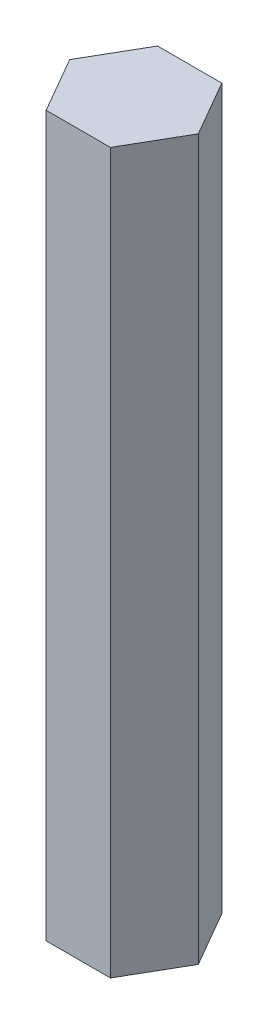
ISO-10303-21;
HEADER;
FILE_DESCRIPTION(('STEP AP214'),'2;1');
FILE_NAME('part.step','',(''),(''),'','','');
FILE_SCHEMA(('AUTOMOTIVE_DESIGN { 1 0 10303 214 1 1 1 1 }'));
ENDSEC;
DATA;
#1=APPLICATION_CONTEXT('core data for automotive mechanical design processes');
#2=APPLICATION_PROTOCOL_DEFINITION('international standard','automotive_design',2000,#1);
#3=PRODUCT_CONTEXT('',#1,'mechanical');
#4=PRODUCT('Part','Part','',(#3));
#5=PRODUCT_RELATED_PRODUCT_CATEGORY('part','',(#4));
#6=PRODUCT_DEFINITION_FORMATION('','',#4);
#7=PRODUCT_DEFINITION_CONTEXT('part definition',#1,'design');
#8=PRODUCT_DEFINITION('design','',#6,#7);
#9=PRODUCT_DEFINITION_SHAPE('','',#8);
#10=(LENGTH_UNIT() NAMED_UNIT(*) SI_UNIT(.MILLI.,.METRE.));
#11=(NAMED_UNIT(*) PLANE_ANGLE_UNIT() SI_UNIT($,.RADIAN.));
#12=(NAMED_UNIT(*) SI_UNIT($,.STERADIAN.) SOLID_ANGLE_UNIT());
#13=UNCERTAINTY_MEASURE_WITH_UNIT(LENGTH_MEASURE(1.E-05),#10,'distance_accuracy_value','');
#14=(GEOMETRIC_REPRESENTATION_CONTEXT(3) GLOBAL_UNCERTAINTY_ASSIGNED_CONTEXT((#13)) GLOBAL_UNIT_ASSIGNED_CONTEXT((#10,
#11,#12)) REPRESENTATION_CONTEXT('',''));
#15=CARTESIAN_POINT('',(0.,0.,0.));
#16=DIRECTION('',(0.,0.,1.));
#17=DIRECTION('',(1.,0.,0.));
#18=AXIS2_PLACEMENT_3D('',#15,#16,#17);
#19=CARTESIAN_POINT('',(3.97705905170191,89.5,5.34885921686965));
#20=DIRECTION('',(-0.866025403784439,0.,-0.5));
#21=DIRECTION('',(-0.5,0.,0.866025403784439));
#22=AXIS2_PLACEMENT_3D('',#19,#20,#21);
#23=PLANE('',#22);
#24=DIRECTION('',(0.5,0.,-0.866025403784439));
#25=VECTOR('',#24,1.);
#26=CARTESIAN_POINT('',(3.97705905170191,0.,5.34885921686965));
#27=LINE('',#26,#25);
#28=CARTESIAN_POINT('',(3.97705905170191,0.,5.34885921686965));
#29=VERTEX_POINT('',#28);
#30=CARTESIAN_POINT('',(7.97705905170191,0.,-1.57934401340586));
#31=VERTEX_POINT('',#30);
#32=EDGE_CURVE('E134',#29,#31,#27,.T.);
#33=ORIENTED_EDGE('',*,*,#32,.T.);
#34=DIRECTION('',(0.,-1.,0.));
#35=VECTOR('',#34,1.);
#36=CARTESIAN_POINT('',(7.97705905170191,89.5,-1.57934401340586));
#37=LINE('',#36,#35);
#38=CARTESIAN_POINT('',(7.97705905170191,89.5,-1.57934401340586));
#39=VERTEX_POINT('',#38);
#40=EDGE_CURVE('E11',#39,#31,#37,.T.);
#41=ORIENTED_EDGE('',*,*,#40,.F.);
#42=DIRECTION('',(0.5,0.,-0.866025403784439));
#43=VECTOR('',#42,1.);
#44=CARTESIAN_POINT('',(3.97705905170191,89.5,5.34885921686965));
#45=LINE('',#44,#43);
#46=CARTESIAN_POINT('',(3.97705905170191,89.5,5.34885921686965));
#47=VERTEX_POINT('',#46);
#48=EDGE_CURVE('E150',#47,#39,#45,.T.);
#49=ORIENTED_EDGE('',*,*,#48,.F.);
#50=DIRECTION('',(0.,-1.,0.));
#51=VECTOR('',#50,1.);
#52=CARTESIAN_POINT('',(3.97705905170191,89.5,5.34885921686965));
#53=LINE('',#52,#51);
#54=EDGE_CURVE('E130',#47,#29,#53,.T.);
#55=ORIENTED_EDGE('',*,*,#54,.T.);
#56=EDGE_LOOP('',(#33,#41,#49,#55));
#57=FACE_BOUND('',#56,.T.);
#58=ADVANCED_FACE('F45',(#57),#23,.F.);
#59=CARTESIAN_POINT('',(7.97705905170191,89.5,-1.57934401340586));
#60=DIRECTION('',(-0.866025403784439,0.,0.5));
#61=DIRECTION('',(0.5,0.,0.866025403784439));
#62=AXIS2_PLACEMENT_3D('',#59,#60,#61);
#63=PLANE('',#62);
#64=DIRECTION('',(-0.5,0.,-0.866025403784439));
#65=VECTOR('',#64,1.);
#66=CARTESIAN_POINT('',(7.97705905170191,0.,-1.57934401340586));
#67=LINE('',#66,#65);
#68=CARTESIAN_POINT('',(3.97705905170191,0.,-8.50754724368137));
#69=VERTEX_POINT('',#68);
#70=EDGE_CURVE('E138',#31,#69,#67,.T.);
#71=ORIENTED_EDGE('',*,*,#70,.T.);
#72=DIRECTION('',(0.,-1.,0.));
#73=VECTOR('',#72,1.);
#74=CARTESIAN_POINT('',(3.97705905170191,89.5,-8.50754724368137));
#75=LINE('',#74,#73);
#76=CARTESIAN_POINT('',(3.97705905170191,89.5,-8.50754724368137));
#77=VERTEX_POINT('',#76);
#78=EDGE_CURVE('E54',#77,#69,#75,.T.);
#79=ORIENTED_EDGE('',*,*,#78,.F.);
#80=DIRECTION('',(-0.5,0.,-0.866025403784439));
#81=VECTOR('',#80,1.);
#82=CARTESIAN_POINT('',(7.97705905170191,89.5,-1.57934401340586));
#83=LINE('',#82,#81);
#84=EDGE_CURVE('E99',#39,#77,#83,.T.);
#85=ORIENTED_EDGE('',*,*,#84,.F.);
#86=ORIENTED_EDGE('',*,*,#40,.T.);
#87=EDGE_LOOP('',(#71,#79,#85,#86));
#88=FACE_BOUND('',#87,.T.);
#89=ADVANCED_FACE('F178',(#88),#63,.F.);
#90=CARTESIAN_POINT('',(3.97705905170191,89.5,-8.50754724368137));
#91=DIRECTION('',(0.,0.,1.));
#92=DIRECTION('',(1.,0.,0.));
#93=AXIS2_PLACEMENT_3D('',#90,#91,#92);
#94=PLANE('',#93);
#95=DIRECTION('',(-1.,0.,0.));
#96=VECTOR('',#95,1.);
#97=CARTESIAN_POINT('',(3.97705905170191,0.,-8.50754724368137));
#98=LINE('',#97,#96);
#99=CARTESIAN_POINT('',(-4.02294094829809,0.,-8.50754724368137));
#100=VERTEX_POINT('',#99);
#101=EDGE_CURVE('E141',#69,#100,#98,.T.);
#102=ORIENTED_EDGE('',*,*,#101,.T.);
#103=DIRECTION('',(0.,-1.,0.));
#104=VECTOR('',#103,1.);
#105=CARTESIAN_POINT('',(-4.02294094829809,89.5,-8.50754724368137));
#106=LINE('',#105,#104);
#107=CARTESIAN_POINT('',(-4.02294094829809,89.5,-8.50754724368137));
#108=VERTEX_POINT('',#107);
#109=EDGE_CURVE('E123',#108,#100,#106,.T.);
#110=ORIENTED_EDGE('',*,*,#109,.F.);
#111=DIRECTION('',(-1.,0.,0.));
#112=VECTOR('',#111,1.);
#113=CARTESIAN_POINT('',(3.97705905170191,89.5,-8.50754724368137));
#114=LINE('',#113,#112);
#115=EDGE_CURVE('E112',#77,#108,#114,.T.);
#116=ORIENTED_EDGE('',*,*,#115,.F.);
#117=ORIENTED_EDGE('',*,*,#78,.T.);
#118=EDGE_LOOP('',(#102,#110,#116,#117));
#119=FACE_BOUND('',#118,.T.);
#120=ADVANCED_FACE('F160',(#119),#94,.F.);
#121=CARTESIAN_POINT('',(-4.02294094829809,89.5,-8.50754724368137));
#122=DIRECTION('',(0.866025403784439,0.,0.5));
#123=DIRECTION('',(0.5,0.,-0.866025403784439));
#124=AXIS2_PLACEMENT_3D('',#121,#122,#123);
#125=PLANE('',#124);
#126=DIRECTION('',(-0.5,0.,0.866025403784439));
#127=VECTOR('',#126,1.);
#128=CARTESIAN_POINT('',(-4.02294094829809,0.,-8.50754724368137));
#129=LINE('',#128,#127);
#130=CARTESIAN_POINT('',(-8.02294094829809,0.,-1.57934401340586));
#131=VERTEX_POINT('',#130);
#132=EDGE_CURVE('E121',#100,#131,#129,.T.);
#133=ORIENTED_EDGE('',*,*,#132,.T.);
#134=DIRECTION('',(0.,-1.,0.));
#135=VECTOR('',#134,1.);
#136=CARTESIAN_POINT('',(-8.02294094829809,89.5,-1.57934401340586));
#137=LINE('',#136,#135);
#138=CARTESIAN_POINT('',(-8.02294094829809,89.5,-1.57934401340586));
#139=VERTEX_POINT('',#138);
#140=EDGE_CURVE('E118',#139,#131,#137,.T.);
#141=ORIENTED_EDGE('',*,*,#140,.F.);
#142=DIRECTION('',(-0.5,0.,0.866025403784439));
#143=VECTOR('',#142,1.);
#144=CARTESIAN_POINT('',(-4.02294094829809,89.5,-8.50754724368137));
#145=LINE('',#144,#143);
#146=EDGE_CURVE('E106',#108,#139,#145,.T.);
#147=ORIENTED_EDGE('',*,*,#146,.F.);
#148=ORIENTED_EDGE('',*,*,#109,.T.);
#149=EDGE_LOOP('',(#133,#141,#147,#148));
#150=FACE_BOUND('',#149,.T.);
#151=ADVANCED_FACE('F119',(#150),#125,.F.);
#152=CARTESIAN_POINT('',(-8.02294094829809,89.5,-1.57934401340586));
#153=DIRECTION('',(0.866025403784438,0.,-0.500000000000001));
#154=DIRECTION('',(-0.500000000000001,0.,-0.866025403784438));
#155=AXIS2_PLACEMENT_3D('',#152,#153,#154);
#156=PLANE('',#155);
#157=DIRECTION('',(0.500000000000001,0.,0.866025403784438));
#158=VECTOR('',#157,1.);
#159=CARTESIAN_POINT('',(-8.02294094829809,0.,-1.57934401340586));
#160=LINE('',#159,#158);
#161=CARTESIAN_POINT('',(-4.02294094829809,0.,5.34885921686965));
#162=VERTEX_POINT('',#161);
#163=EDGE_CURVE('E85',#131,#162,#160,.T.);
#164=ORIENTED_EDGE('',*,*,#163,.T.);
#165=DIRECTION('',(0.,-1.,0.));
#166=VECTOR('',#165,1.);
#167=CARTESIAN_POINT('',(-4.02294094829809,89.5,5.34885921686965));
#168=LINE('',#167,#166);
#169=CARTESIAN_POINT('',(-4.02294094829809,89.5,5.34885921686965));
#170=VERTEX_POINT('',#169);
#171=EDGE_CURVE('E124',#170,#162,#168,.T.);
#172=ORIENTED_EDGE('',*,*,#171,.F.);
#173=DIRECTION('',(0.500000000000001,0.,0.866025403784438));
#174=VECTOR('',#173,1.);
#175=CARTESIAN_POINT('',(-8.02294094829809,89.5,-1.57934401340586));
#176=LINE('',#175,#174);
#177=EDGE_CURVE('E110',#139,#170,#176,.T.);
#178=ORIENTED_EDGE('',*,*,#177,.F.);
#179=ORIENTED_EDGE('',*,*,#140,.T.);
#180=EDGE_LOOP('',(#164,#172,#178,#179));
#181=FACE_BOUND('',#180,.T.);
#182=ADVANCED_FACE('F126',(#181),#156,.F.);
#183=CARTESIAN_POINT('',(-4.02294094829809,89.5,5.34885921686965));
#184=DIRECTION('',(0.,0.,-1.));
#185=DIRECTION('',(-1.,0.,0.));
#186=AXIS2_PLACEMENT_3D('',#183,#184,#185);
#187=PLANE('',#186);
#188=DIRECTION('',(1.,0.,0.));
#189=VECTOR('',#188,1.);
#190=CARTESIAN_POINT('',(-4.02294094829809,0.,5.34885921686965));
#191=LINE('',#190,#189);
#192=EDGE_CURVE('E91',#162,#29,#191,.T.);
#193=ORIENTED_EDGE('',*,*,#192,.T.);
#194=ORIENTED_EDGE('',*,*,#54,.F.);
#195=DIRECTION('',(1.,0.,0.));
#196=VECTOR('',#195,1.);
#197=CARTESIAN_POINT('',(-4.02294094829809,89.5,5.34885921686965));
#198=LINE('',#197,#196);
#199=EDGE_CURVE('E62',#170,#47,#198,.T.);
#200=ORIENTED_EDGE('',*,*,#199,.F.);
#201=ORIENTED_EDGE('',*,*,#171,.T.);
#202=EDGE_LOOP('',(#193,#194,#200,#201));
#203=FACE_BOUND('',#202,.T.);
#204=ADVANCED_FACE('F167',(#203),#187,.F.);
#205=CARTESIAN_POINT('',(0.,89.5,0.));
#206=DIRECTION('',(0.,1.,0.));
#207=DIRECTION('',(0.,0.,1.));
#208=AXIS2_PLACEMENT_3D('',#205,#206,#207);
#209=PLANE('',#208);
#210=ORIENTED_EDGE('',*,*,#48,.T.);
#211=ORIENTED_EDGE('',*,*,#84,.T.);
#212=ORIENTED_EDGE('',*,*,#115,.T.);
#213=ORIENTED_EDGE('',*,*,#146,.T.);
#214=ORIENTED_EDGE('',*,*,#177,.T.);
#215=ORIENTED_EDGE('',*,*,#199,.T.);
#216=EDGE_LOOP('',(#210,#211,#212,#213,#214,#215));
#217=FACE_BOUND('',#216,.T.);
#218=ADVANCED_FACE('F108',(#217),#209,.T.);
#219=CARTESIAN_POINT('',(0.,0.,0.));
#220=DIRECTION('',(0.,1.,0.));
#221=DIRECTION('',(0.,0.,1.));
#222=AXIS2_PLACEMENT_3D('',#219,#220,#221);
#223=PLANE('',#222);
#224=ORIENTED_EDGE('',*,*,#32,.F.);
#225=ORIENTED_EDGE('',*,*,#192,.F.);
#226=ORIENTED_EDGE('',*,*,#163,.F.);
#227=ORIENTED_EDGE('',*,*,#132,.F.);
#228=ORIENTED_EDGE('',*,*,#101,.F.);
#229=ORIENTED_EDGE('',*,*,#70,.F.);
#230=EDGE_LOOP('',(#224,#225,#226,#227,#228,#229));
#231=FACE_BOUND('',#230,.T.);
#232=ADVANCED_FACE('F163',(#231),#223,.F.);
#233=CLOSED_SHELL('',(#58,#89,#120,#151,#182,#204,#218,#232));
#234=MANIFOLD_SOLID_BREP('B2',#233);
#235=ADVANCED_BREP_SHAPE_REPRESENTATION('',(#18,#234),#14);
#236=SHAPE_DEFINITION_REPRESENTATION(#9,#235);
ENDSEC;
END-ISO-10303-21;
